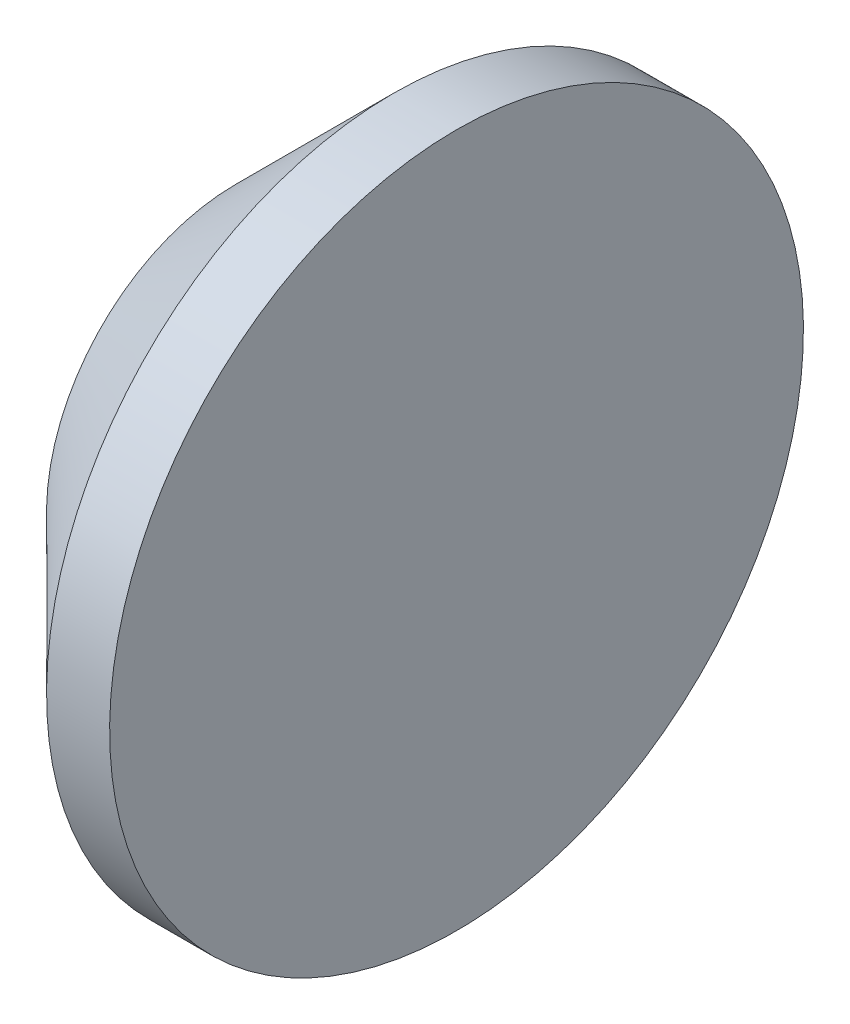
ISO-10303-21;
HEADER;
FILE_DESCRIPTION(('STEP AP214'),'2;1');
FILE_NAME('part.step','',(''),(''),'','','');
FILE_SCHEMA(('AUTOMOTIVE_DESIGN { 1 0 10303 214 1 1 1 1 }'));
ENDSEC;
DATA;
#1=APPLICATION_CONTEXT('core data for automotive mechanical design processes');
#2=APPLICATION_PROTOCOL_DEFINITION('international standard','automotive_design',2000,#1);
#3=PRODUCT_CONTEXT('',#1,'mechanical');
#4=PRODUCT('Part','Part','',(#3));
#5=PRODUCT_RELATED_PRODUCT_CATEGORY('part','',(#4));
#6=PRODUCT_DEFINITION_FORMATION('','',#4);
#7=PRODUCT_DEFINITION_CONTEXT('part definition',#1,'design');
#8=PRODUCT_DEFINITION('design','',#6,#7);
#9=PRODUCT_DEFINITION_SHAPE('','',#8);
#10=(LENGTH_UNIT() NAMED_UNIT(*) SI_UNIT(.MILLI.,.METRE.));
#11=(NAMED_UNIT(*) PLANE_ANGLE_UNIT() SI_UNIT($,.RADIAN.));
#12=(NAMED_UNIT(*) SI_UNIT($,.STERADIAN.) SOLID_ANGLE_UNIT());
#13=UNCERTAINTY_MEASURE_WITH_UNIT(LENGTH_MEASURE(1.E-05),#10,'distance_accuracy_value','');
#14=(GEOMETRIC_REPRESENTATION_CONTEXT(3) GLOBAL_UNCERTAINTY_ASSIGNED_CONTEXT((#13)) GLOBAL_UNIT_ASSIGNED_CONTEXT((#10,
#11,#12)) REPRESENTATION_CONTEXT('',''));
#15=CARTESIAN_POINT('',(0.,0.,0.));
#16=DIRECTION('',(0.,0.,1.));
#17=DIRECTION('',(1.,0.,0.));
#18=AXIS2_PLACEMENT_3D('',#15,#16,#17);
#19=CARTESIAN_POINT('',(-4.5,0.,0.));
#20=DIRECTION('',(1.,0.,0.));
#21=DIRECTION('',(0.,1.,0.));
#22=AXIS2_PLACEMENT_3D('',#19,#20,#21);
#23=CYLINDRICAL_SURFACE('',#22,5.);
#24=CARTESIAN_POINT('',(-7.,0.,0.));
#25=DIRECTION('',(-1.,0.,0.));
#26=DIRECTION('',(0.,0.,1.));
#27=AXIS2_PLACEMENT_3D('',#24,#25,#26);
#28=CIRCLE('',#27,5.);
#29=CARTESIAN_POINT('',(-7.,5.,0.));
#30=VERTEX_POINT('',#29);
#31=EDGE_CURVE('E10',#30,#30,#28,.T.);
#32=ORIENTED_EDGE('',*,*,#31,.T.);
#33=EDGE_LOOP('',(#32));
#34=FACE_BOUND('',#33,.T.);
#35=CARTESIAN_POINT('',(-2.,0.,0.));
#36=DIRECTION('',(-1.,0.,0.));
#37=DIRECTION('',(0.,0.,1.));
#38=AXIS2_PLACEMENT_3D('',#35,#36,#37);
#39=CIRCLE('',#38,5.);
#40=CARTESIAN_POINT('',(-2.,5.,0.));
#41=VERTEX_POINT('',#40);
#42=EDGE_CURVE('E42',#41,#41,#39,.T.);
#43=ORIENTED_EDGE('',*,*,#42,.F.);
#44=EDGE_LOOP('',(#43));
#45=FACE_BOUND('',#44,.T.);
#46=ADVANCED_FACE('F15',(#34,#45),#23,.F.);
#47=CARTESIAN_POINT('',(-7.,5.,0.));
#48=DIRECTION('',(-1.,0.,0.));
#49=DIRECTION('',(0.,0.,1.));
#50=AXIS2_PLACEMENT_3D('',#47,#48,#49);
#51=PLANE('',#50);
#52=CARTESIAN_POINT('',(-7.,0.,0.));
#53=DIRECTION('',(-1.,0.,0.));
#54=DIRECTION('',(0.,0.,1.));
#55=AXIS2_PLACEMENT_3D('',#52,#53,#54);
#56=CIRCLE('',#55,6.);
#57=CARTESIAN_POINT('',(-7.,6.,0.));
#58=VERTEX_POINT('',#57);
#59=EDGE_CURVE('E24',#58,#58,#56,.T.);
#60=ORIENTED_EDGE('',*,*,#59,.T.);
#61=EDGE_LOOP('',(#60));
#62=FACE_BOUND('',#61,.T.);
#63=ORIENTED_EDGE('',*,*,#31,.F.);
#64=EDGE_LOOP('',(#63));
#65=FACE_BOUND('',#64,.T.);
#66=ADVANCED_FACE('F58',(#62,#65),#51,.T.);
#67=CARTESIAN_POINT('',(-4.5,0.,0.));
#68=DIRECTION('',(1.,0.,0.));
#69=DIRECTION('',(0.,1.,0.));
#70=AXIS2_PLACEMENT_3D('',#67,#68,#69);
#71=CONICAL_SURFACE('',#70,8.5,0.785398163397448);
#72=CARTESIAN_POINT('',(-2.,0.,0.));
#73=DIRECTION('',(-1.,0.,0.));
#74=DIRECTION('',(0.,0.,1.));
#75=AXIS2_PLACEMENT_3D('',#72,#73,#74);
#76=CIRCLE('',#75,11.);
#77=CARTESIAN_POINT('',(-2.,11.,0.));
#78=VERTEX_POINT('',#77);
#79=EDGE_CURVE('E51',#78,#78,#76,.T.);
#80=ORIENTED_EDGE('',*,*,#79,.T.);
#81=EDGE_LOOP('',(#80));
#82=FACE_BOUND('',#81,.T.);
#83=ORIENTED_EDGE('',*,*,#59,.F.);
#84=EDGE_LOOP('',(#83));
#85=FACE_BOUND('',#84,.T.);
#86=ADVANCED_FACE('F61',(#82,#85),#71,.T.);
#87=CARTESIAN_POINT('',(-1.,0.,0.));
#88=DIRECTION('',(1.,0.,0.));
#89=DIRECTION('',(0.,1.,0.));
#90=AXIS2_PLACEMENT_3D('',#87,#88,#89);
#91=CYLINDRICAL_SURFACE('',#90,11.);
#92=CARTESIAN_POINT('',(0.,0.,0.));
#93=DIRECTION('',(-1.,0.,0.));
#94=DIRECTION('',(0.,0.,1.));
#95=AXIS2_PLACEMENT_3D('',#92,#93,#94);
#96=CIRCLE('',#95,11.);
#97=CARTESIAN_POINT('',(0.,11.,0.));
#98=VERTEX_POINT('',#97);
#99=EDGE_CURVE('E37',#98,#98,#96,.T.);
#100=ORIENTED_EDGE('',*,*,#99,.T.);
#101=EDGE_LOOP('',(#100));
#102=FACE_BOUND('',#101,.T.);
#103=ORIENTED_EDGE('',*,*,#79,.F.);
#104=EDGE_LOOP('',(#103));
#105=FACE_BOUND('',#104,.T.);
#106=ADVANCED_FACE('F63',(#102,#105),#91,.T.);
#107=CARTESIAN_POINT('',(0.,11.,0.));
#108=DIRECTION('',(1.,0.,0.));
#109=DIRECTION('',(0.,0.,-1.));
#110=AXIS2_PLACEMENT_3D('',#107,#108,#109);
#111=PLANE('',#110);
#112=ORIENTED_EDGE('',*,*,#99,.F.);
#113=EDGE_LOOP('',(#112));
#114=FACE_BOUND('',#113,.T.);
#115=ADVANCED_FACE('F71',(#114),#111,.T.);
#116=CARTESIAN_POINT('',(-2.,0.,0.));
#117=DIRECTION('',(-1.,0.,0.));
#118=DIRECTION('',(0.,0.,1.));
#119=AXIS2_PLACEMENT_3D('',#116,#117,#118);
#120=PLANE('',#119);
#121=ORIENTED_EDGE('',*,*,#42,.T.);
#122=EDGE_LOOP('',(#121));
#123=FACE_BOUND('',#122,.T.);
#124=ADVANCED_FACE('F43',(#123),#120,.T.);
#125=CLOSED_SHELL('',(#46,#66,#86,#106,#115,#124));
#126=MANIFOLD_SOLID_BREP('B1',#125);
#127=ADVANCED_BREP_SHAPE_REPRESENTATION('',(#18,#126),#14);
#128=SHAPE_DEFINITION_REPRESENTATION(#9,#127);
ENDSEC;
END-ISO-10303-21;
